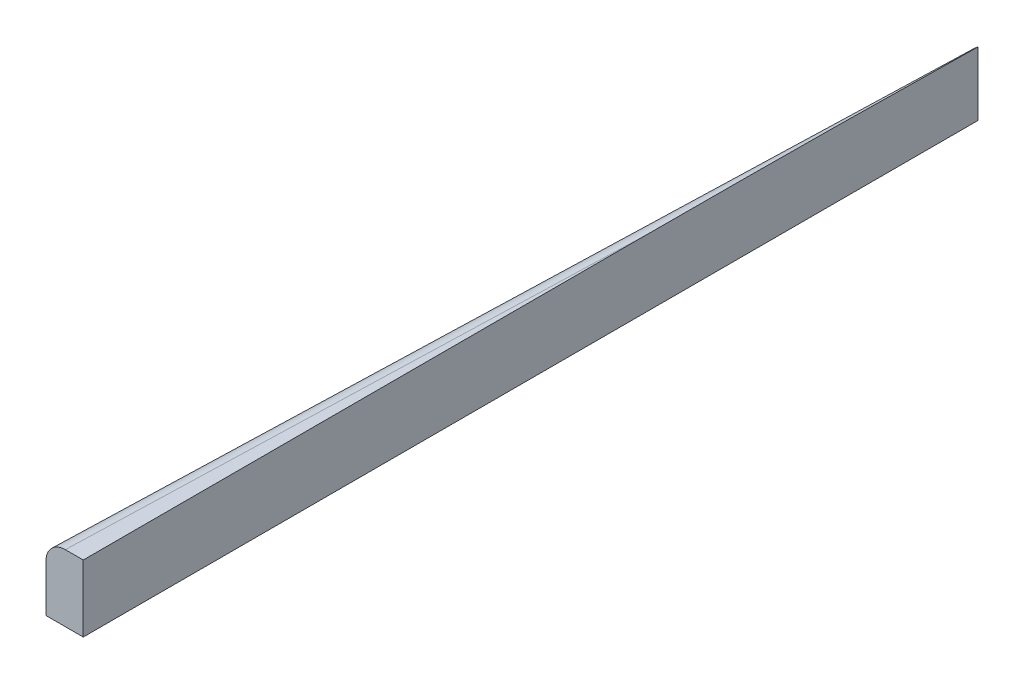
ISO-10303-21;
HEADER;
FILE_DESCRIPTION(('STEP AP214'),'2;1');
FILE_NAME('part.step','',(''),(''),'','','');
FILE_SCHEMA(('AUTOMOTIVE_DESIGN { 1 0 10303 214 1 1 1 1 }'));
ENDSEC;
DATA;
#1=APPLICATION_CONTEXT('core data for automotive mechanical design processes');
#2=APPLICATION_PROTOCOL_DEFINITION('international standard','automotive_design',2000,#1);
#3=PRODUCT_CONTEXT('',#1,'mechanical');
#4=PRODUCT('Part','Part','',(#3));
#5=PRODUCT_RELATED_PRODUCT_CATEGORY('part','',(#4));
#6=PRODUCT_DEFINITION_FORMATION('','',#4);
#7=PRODUCT_DEFINITION_CONTEXT('part definition',#1,'design');
#8=PRODUCT_DEFINITION('design','',#6,#7);
#9=PRODUCT_DEFINITION_SHAPE('','',#8);
#10=(LENGTH_UNIT() NAMED_UNIT(*) SI_UNIT(.MILLI.,.METRE.));
#11=(NAMED_UNIT(*) PLANE_ANGLE_UNIT() SI_UNIT($,.RADIAN.));
#12=(NAMED_UNIT(*) SI_UNIT($,.STERADIAN.) SOLID_ANGLE_UNIT());
#13=UNCERTAINTY_MEASURE_WITH_UNIT(LENGTH_MEASURE(1.E-05),#10,'distance_accuracy_value','');
#14=(GEOMETRIC_REPRESENTATION_CONTEXT(3) GLOBAL_UNCERTAINTY_ASSIGNED_CONTEXT((#13)) GLOBAL_UNIT_ASSIGNED_CONTEXT((#10,
#11,#12)) REPRESENTATION_CONTEXT('',''));
#15=CARTESIAN_POINT('',(0.,0.,0.));
#16=DIRECTION('',(0.,0.,1.));
#17=DIRECTION('',(1.,0.,0.));
#18=AXIS2_PLACEMENT_3D('',#15,#16,#17);
#19=CARTESIAN_POINT('',(0.,0.,-584.2));
#20=DIRECTION('',(0.,0.,1.));
#21=DIRECTION('',(1.,0.,0.));
#22=AXIS2_PLACEMENT_3D('',#19,#20,#21);
#23=PLANE('',#22);
#24=DIRECTION('',(0.,-1.,0.));
#25=VECTOR('',#24,1.);
#26=CARTESIAN_POINT('',(-18.161,0.,-584.2));
#27=LINE('',#26,#25);
#28=CARTESIAN_POINT('',(-18.161,49.911,-584.2));
#29=VERTEX_POINT('',#28);
#30=CARTESIAN_POINT('',(-18.161,5.96900000000002,-584.2));
#31=VERTEX_POINT('',#30);
#32=EDGE_CURVE('E108',#29,#31,#27,.T.);
#33=ORIENTED_EDGE('',*,*,#32,.F.);
#34=DIRECTION('',(-1.,0.,0.));
#35=VECTOR('',#34,1.);
#36=CARTESIAN_POINT('',(-49.911,49.911,-584.2));
#37=LINE('',#36,#35);
#38=CARTESIAN_POINT('',(-29.9639479786131,49.911,-584.2));
#39=VERTEX_POINT('',#38);
#40=EDGE_CURVE('E109',#29,#39,#37,.T.);
#41=ORIENTED_EDGE('',*,*,#40,.T.);
#42=CARTESIAN_POINT('',(-29.9639479786131,37.211,-584.2));
#43=DIRECTION('',(0.,0.,1.));
#44=DIRECTION('',(-1.,0.,0.));
#45=AXIS2_PLACEMENT_3D('',#42,#43,#44);
#46=ELLIPSE('',#45,12.7063746568218,12.7);
#47=CARTESIAN_POINT('',(-42.6703226354349,37.211,-584.2));
#48=VERTEX_POINT('',#47);
#49=EDGE_CURVE('E113',#48,#39,#46,.F.);
#50=ORIENTED_EDGE('',*,*,#49,.F.);
#51=DIRECTION('',(0.,-1.,0.));
#52=VECTOR('',#51,1.);
#53=CARTESIAN_POINT('',(-42.6703226354349,0.,-584.2));
#54=LINE('',#53,#52);
#55=CARTESIAN_POINT('',(-42.6703226354349,5.96900000000002,-584.2));
#56=VERTEX_POINT('',#55);
#57=EDGE_CURVE('E95',#48,#56,#54,.T.);
#58=ORIENTED_EDGE('',*,*,#57,.T.);
#59=DIRECTION('',(1.,0.,0.));
#60=VECTOR('',#59,1.);
#61=CARTESIAN_POINT('',(0.,5.96900000000002,-584.2));
#62=LINE('',#61,#60);
#63=EDGE_CURVE('E104',#56,#31,#62,.T.);
#64=ORIENTED_EDGE('',*,*,#63,.T.);
#65=EDGE_LOOP('',(#33,#41,#50,#58,#64));
#66=FACE_BOUND('',#65,.T.);
#67=ADVANCED_FACE('F43',(#66),#23,.T.);
#68=CARTESIAN_POINT('',(0.,5.96900000000002,0.));
#69=DIRECTION('',(0.,1.,0.));
#70=DIRECTION('',(0.,0.,1.));
#71=AXIS2_PLACEMENT_3D('',#68,#69,#70);
#72=PLANE('',#71);
#73=ORIENTED_EDGE('',*,*,#63,.F.);
#74=DIRECTION('',(-0.0316721902279268,0.,0.999498310336824));
#75=VECTOR('',#74,1.);
#76=CARTESIAN_POINT('',(-61.1211296763861,5.96900000000002,-1.93681172447797));
#77=LINE('',#76,#75);
#78=CARTESIAN_POINT('',(-24.0069483527925,5.96900000000001,-1173.17130026192));
#79=VERTEX_POINT('',#78);
#80=EDGE_CURVE('E91',#79,#56,#77,.T.);
#81=ORIENTED_EDGE('',*,*,#80,.F.);
#82=DIRECTION('',(-1.,0.,0.));
#83=VECTOR('',#82,1.);
#84=CARTESIAN_POINT('',(0.,5.96900000000002,-1173.17130026192));
#85=LINE('',#84,#83);
#86=CARTESIAN_POINT('',(-18.161,5.96900000000002,-1173.17130026192));
#87=VERTEX_POINT('',#86);
#88=EDGE_CURVE('E100',#87,#79,#85,.T.);
#89=ORIENTED_EDGE('',*,*,#88,.F.);
#90=DIRECTION('',(0.,0.,1.));
#91=VECTOR('',#90,1.);
#92=CARTESIAN_POINT('',(-18.161,5.96900000000002,0.));
#93=LINE('',#92,#91);
#94=EDGE_CURVE('E106',#87,#31,#93,.T.);
#95=ORIENTED_EDGE('',*,*,#94,.T.);
#96=EDGE_LOOP('',(#73,#81,#89,#95));
#97=FACE_BOUND('',#96,.T.);
#98=ADVANCED_FACE('F105',(#97),#72,.F.);
#99=CARTESIAN_POINT('',(-49.911,49.911,25.4));
#100=DIRECTION('',(0.,-1.,0.));
#101=DIRECTION('',(0.,0.,-1.));
#102=AXIS2_PLACEMENT_3D('',#99,#100,#101);
#103=PLANE('',#102);
#104=ORIENTED_EDGE('',*,*,#40,.F.);
#105=DIRECTION('',(0.,0.,1.));
#106=VECTOR('',#105,1.);
#107=CARTESIAN_POINT('',(-18.161,49.911,25.4));
#108=LINE('',#107,#106);
#109=CARTESIAN_POINT('',(-18.161,49.911,-956.672711129882));
#110=VERTEX_POINT('',#109);
#111=EDGE_CURVE('E11',#110,#29,#108,.T.);
#112=ORIENTED_EDGE('',*,*,#111,.F.);
#113=DIRECTION('',(-0.0316721902279268,0.,0.999498310336824));
#114=VECTOR('',#113,1.);
#115=CARTESIAN_POINT('',(-49.2816382741247,49.911,25.4199432696363));
#116=LINE('',#115,#114);
#117=EDGE_CURVE('E120',#110,#39,#116,.T.);
#118=ORIENTED_EDGE('',*,*,#117,.T.);
#119=EDGE_LOOP('',(#104,#112,#118));
#120=FACE_BOUND('',#119,.T.);
#121=ADVANCED_FACE('F133',(#120),#103,.F.);
#122=CARTESIAN_POINT('',(-18.161,0.,0.));
#123=DIRECTION('',(1.,0.,0.));
#124=DIRECTION('',(0.,0.,-1.));
#125=AXIS2_PLACEMENT_3D('',#122,#123,#124);
#126=PLANE('',#125);
#127=ORIENTED_EDGE('',*,*,#111,.T.);
#128=ORIENTED_EDGE('',*,*,#32,.T.);
#129=ORIENTED_EDGE('',*,*,#94,.F.);
#130=DIRECTION('',(0.,1.,0.));
#131=VECTOR('',#130,1.);
#132=CARTESIAN_POINT('',(-18.161,0.,-1173.17130026192));
#133=LINE('',#132,#131);
#134=CARTESIAN_POINT('',(-18.161,47.9007971720491,-1173.17130026192));
#135=VERTEX_POINT('',#134);
#136=EDGE_CURVE('E52',#87,#135,#133,.T.);
#137=ORIENTED_EDGE('',*,*,#136,.T.);
#138=CARTESIAN_POINT('',(-18.161,37.211,-956.672711129882));
#139=DIRECTION('',(1.,0.,0.));
#140=DIRECTION('',(0.,0.,1.));
#141=AXIS2_PLACEMENT_3D('',#138,#139,#140);
#142=ELLIPSE('',#141,400.982688870119,12.7);
#143=EDGE_CURVE('E59',#110,#135,#142,.F.);
#144=ORIENTED_EDGE('',*,*,#143,.F.);
#145=EDGE_LOOP('',(#127,#128,#129,#137,#144));
#146=FACE_BOUND('',#145,.T.);
#147=ADVANCED_FACE('F45',(#146),#126,.T.);
#148=CARTESIAN_POINT('',(-49.2816382741247,37.211,25.4199432696363));
#149=DIRECTION('',(-0.0316721902279268,0.,0.999498310336824));
#150=DIRECTION('',(0.999498310336824,0.,0.0316721902279268));
#151=AXIS2_PLACEMENT_3D('',#148,#149,#150);
#152=CYLINDRICAL_SURFACE('',#151,12.7);
#153=DIRECTION('',(-0.0316721902279268,0.,0.999498310336824));
#154=VECTOR('',#153,1.);
#155=CARTESIAN_POINT('',(-61.1211296763861,37.211,-1.93681172447797));
#156=LINE('',#155,#154);
#157=CARTESIAN_POINT('',(-24.0069483527925,37.211,-1173.17130026192));
#158=VERTEX_POINT('',#157);
#159=EDGE_CURVE('E99',#48,#158,#156,.F.);
#160=ORIENTED_EDGE('',*,*,#159,.F.);
#161=ORIENTED_EDGE('',*,*,#49,.T.);
#162=ORIENTED_EDGE('',*,*,#117,.F.);
#163=ORIENTED_EDGE('',*,*,#143,.T.);
#164=CARTESIAN_POINT('',(-11.3005736959707,37.211,-1173.17130026192));
#165=DIRECTION('',(0.,0.,1.));
#166=DIRECTION('',(-1.,0.,0.));
#167=AXIS2_PLACEMENT_3D('',#164,#165,#166);
#168=ELLIPSE('',#167,12.7063746568218,12.7);
#169=EDGE_CURVE('E122',#158,#135,#168,.F.);
#170=ORIENTED_EDGE('',*,*,#169,.F.);
#171=EDGE_LOOP('',(#160,#161,#162,#163,#170));
#172=FACE_BOUND('',#171,.T.);
#173=ADVANCED_FACE('F136',(#172),#152,.T.);
#174=CARTESIAN_POINT('',(-61.1211296763861,0.,-1.93681172447797));
#175=DIRECTION('',(0.999498310336824,0.,0.0316721902279268));
#176=DIRECTION('',(0.0316721902279268,0.,-0.999498310336824));
#177=AXIS2_PLACEMENT_3D('',#174,#175,#176);
#178=PLANE('',#177);
#179=ORIENTED_EDGE('',*,*,#57,.F.);
#180=ORIENTED_EDGE('',*,*,#159,.T.);
#181=DIRECTION('',(0.,-1.,0.));
#182=VECTOR('',#181,1.);
#183=CARTESIAN_POINT('',(-24.0069483527925,0.,-1173.17130026192));
#184=LINE('',#183,#182);
#185=EDGE_CURVE('E97',#158,#79,#184,.T.);
#186=ORIENTED_EDGE('',*,*,#185,.T.);
#187=ORIENTED_EDGE('',*,*,#80,.T.);
#188=EDGE_LOOP('',(#179,#180,#186,#187));
#189=FACE_BOUND('',#188,.T.);
#190=ADVANCED_FACE('F93',(#189),#178,.F.);
#191=CARTESIAN_POINT('',(0.,0.,-1173.17130026192));
#192=DIRECTION('',(0.,0.,1.));
#193=DIRECTION('',(1.,0.,0.));
#194=AXIS2_PLACEMENT_3D('',#191,#192,#193);
#195=PLANE('',#194);
#196=ORIENTED_EDGE('',*,*,#136,.F.);
#197=ORIENTED_EDGE('',*,*,#88,.T.);
#198=ORIENTED_EDGE('',*,*,#185,.F.);
#199=ORIENTED_EDGE('',*,*,#169,.T.);
#200=EDGE_LOOP('',(#196,#197,#198,#199));
#201=FACE_BOUND('',#200,.T.);
#202=ADVANCED_FACE('F139',(#201),#195,.F.);
#203=CLOSED_SHELL('',(#67,#98,#121,#147,#173,#190,#202));
#204=MANIFOLD_SOLID_BREP('B2',#203);
#205=ADVANCED_BREP_SHAPE_REPRESENTATION('',(#18,#204),#14);
#206=SHAPE_DEFINITION_REPRESENTATION(#9,#205);
ENDSEC;
END-ISO-10303-21;
